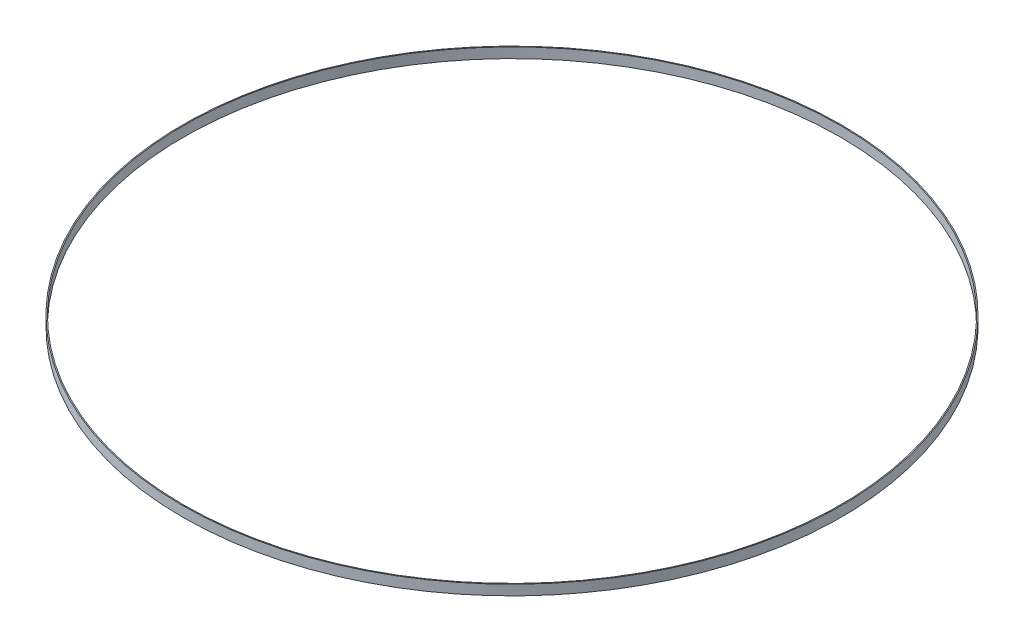
ISO-10303-21;
HEADER;
FILE_DESCRIPTION(('STEP AP214'),'2;1');
FILE_NAME('part.step','',(''),(''),'','','');
FILE_SCHEMA(('AUTOMOTIVE_DESIGN { 1 0 10303 214 1 1 1 1 }'));
ENDSEC;
DATA;
#1=APPLICATION_CONTEXT('core data for automotive mechanical design processes');
#2=APPLICATION_PROTOCOL_DEFINITION('international standard','automotive_design',2000,#1);
#3=PRODUCT_CONTEXT('',#1,'mechanical');
#4=PRODUCT('Part','Part','',(#3));
#5=PRODUCT_RELATED_PRODUCT_CATEGORY('part','',(#4));
#6=PRODUCT_DEFINITION_FORMATION('','',#4);
#7=PRODUCT_DEFINITION_CONTEXT('part definition',#1,'design');
#8=PRODUCT_DEFINITION('design','',#6,#7);
#9=PRODUCT_DEFINITION_SHAPE('','',#8);
#10=(LENGTH_UNIT() NAMED_UNIT(*) SI_UNIT(.MILLI.,.METRE.));
#11=(NAMED_UNIT(*) PLANE_ANGLE_UNIT() SI_UNIT($,.RADIAN.));
#12=(NAMED_UNIT(*) SI_UNIT($,.STERADIAN.) SOLID_ANGLE_UNIT());
#13=UNCERTAINTY_MEASURE_WITH_UNIT(LENGTH_MEASURE(1.E-05),#10,'distance_accuracy_value','');
#14=(GEOMETRIC_REPRESENTATION_CONTEXT(3) GLOBAL_UNCERTAINTY_ASSIGNED_CONTEXT((#13)) GLOBAL_UNIT_ASSIGNED_CONTEXT((#10,
#11,#12)) REPRESENTATION_CONTEXT('',''));
#15=CARTESIAN_POINT('',(0.,0.,0.));
#16=DIRECTION('',(0.,0.,1.));
#17=DIRECTION('',(1.,0.,0.));
#18=AXIS2_PLACEMENT_3D('',#15,#16,#17);
#19=CARTESIAN_POINT('',(0.,2.54,0.));
#20=DIRECTION('',(0.,1.,0.));
#21=DIRECTION('',(0.,0.,1.));
#22=AXIS2_PLACEMENT_3D('',#19,#20,#21);
#23=PLANE('',#22);
#24=CARTESIAN_POINT('',(0.,2.54,0.));
#25=DIRECTION('',(0.,1.,0.));
#26=DIRECTION('',(0.,0.,1.));
#27=AXIS2_PLACEMENT_3D('',#24,#25,#26);
#28=CIRCLE('',#27,82.55);
#29=CARTESIAN_POINT('',(0.,2.54,82.55));
#30=VERTEX_POINT('',#29);
#31=EDGE_CURVE('E10',#30,#30,#28,.T.);
#32=ORIENTED_EDGE('',*,*,#31,.T.);
#33=EDGE_LOOP('',(#32));
#34=FACE_BOUND('',#33,.T.);
#35=CARTESIAN_POINT('',(0.,2.54,0.));
#36=DIRECTION('',(0.,1.,0.));
#37=DIRECTION('',(0.,0.,1.));
#38=AXIS2_PLACEMENT_3D('',#35,#36,#37);
#39=CIRCLE('',#38,82.296);
#40=CARTESIAN_POINT('',(0.,2.54,82.296));
#41=VERTEX_POINT('',#40);
#42=EDGE_CURVE('E41',#41,#41,#39,.T.);
#43=ORIENTED_EDGE('',*,*,#42,.F.);
#44=EDGE_LOOP('',(#43));
#45=FACE_BOUND('',#44,.T.);
#46=ADVANCED_FACE('F30',(#34,#45),#23,.T.);
#47=CARTESIAN_POINT('',(0.,0.,0.));
#48=DIRECTION('',(0.,1.,0.));
#49=DIRECTION('',(0.,0.,1.));
#50=AXIS2_PLACEMENT_3D('',#47,#48,#49);
#51=PLANE('',#50);
#52=CARTESIAN_POINT('',(0.,0.,0.));
#53=DIRECTION('',(0.,1.,0.));
#54=DIRECTION('',(0.,0.,1.));
#55=AXIS2_PLACEMENT_3D('',#52,#53,#54);
#56=CIRCLE('',#55,82.55);
#57=CARTESIAN_POINT('',(0.,0.,82.55));
#58=VERTEX_POINT('',#57);
#59=EDGE_CURVE('E34',#58,#58,#56,.T.);
#60=ORIENTED_EDGE('',*,*,#59,.F.);
#61=EDGE_LOOP('',(#60));
#62=FACE_BOUND('',#61,.T.);
#63=CARTESIAN_POINT('',(0.,0.,0.));
#64=DIRECTION('',(0.,1.,0.));
#65=DIRECTION('',(0.,0.,1.));
#66=AXIS2_PLACEMENT_3D('',#63,#64,#65);
#67=CIRCLE('',#66,82.296);
#68=CARTESIAN_POINT('',(0.,0.,82.296));
#69=VERTEX_POINT('',#68);
#70=EDGE_CURVE('E43',#69,#69,#67,.T.);
#71=ORIENTED_EDGE('',*,*,#70,.T.);
#72=EDGE_LOOP('',(#71));
#73=FACE_BOUND('',#72,.T.);
#74=ADVANCED_FACE('F53',(#62,#73),#51,.F.);
#75=CARTESIAN_POINT('',(0.,2.54,0.));
#76=DIRECTION('',(0.,-1.,0.));
#77=DIRECTION('',(0.,0.,-1.));
#78=AXIS2_PLACEMENT_3D('',#75,#76,#77);
#79=CYLINDRICAL_SURFACE('',#78,82.55);
#80=ORIENTED_EDGE('',*,*,#31,.F.);
#81=EDGE_LOOP('',(#80));
#82=FACE_BOUND('',#81,.T.);
#83=ORIENTED_EDGE('',*,*,#59,.T.);
#84=EDGE_LOOP('',(#83));
#85=FACE_BOUND('',#84,.T.);
#86=ADVANCED_FACE('F32',(#82,#85),#79,.T.);
#87=CARTESIAN_POINT('',(0.,2.54,0.));
#88=DIRECTION('',(0.,-1.,0.));
#89=DIRECTION('',(0.,0.,-1.));
#90=AXIS2_PLACEMENT_3D('',#87,#88,#89);
#91=CYLINDRICAL_SURFACE('',#90,82.296);
#92=ORIENTED_EDGE('',*,*,#42,.T.);
#93=EDGE_LOOP('',(#92));
#94=FACE_BOUND('',#93,.T.);
#95=ORIENTED_EDGE('',*,*,#70,.F.);
#96=EDGE_LOOP('',(#95));
#97=FACE_BOUND('',#96,.T.);
#98=ADVANCED_FACE('F49',(#94,#97),#91,.F.);
#99=CLOSED_SHELL('',(#46,#74,#86,#98));
#100=MANIFOLD_SOLID_BREP('B2',#99);
#101=ADVANCED_BREP_SHAPE_REPRESENTATION('',(#18,#100),#14);
#102=SHAPE_DEFINITION_REPRESENTATION(#9,#101);
ENDSEC;
END-ISO-10303-21;
